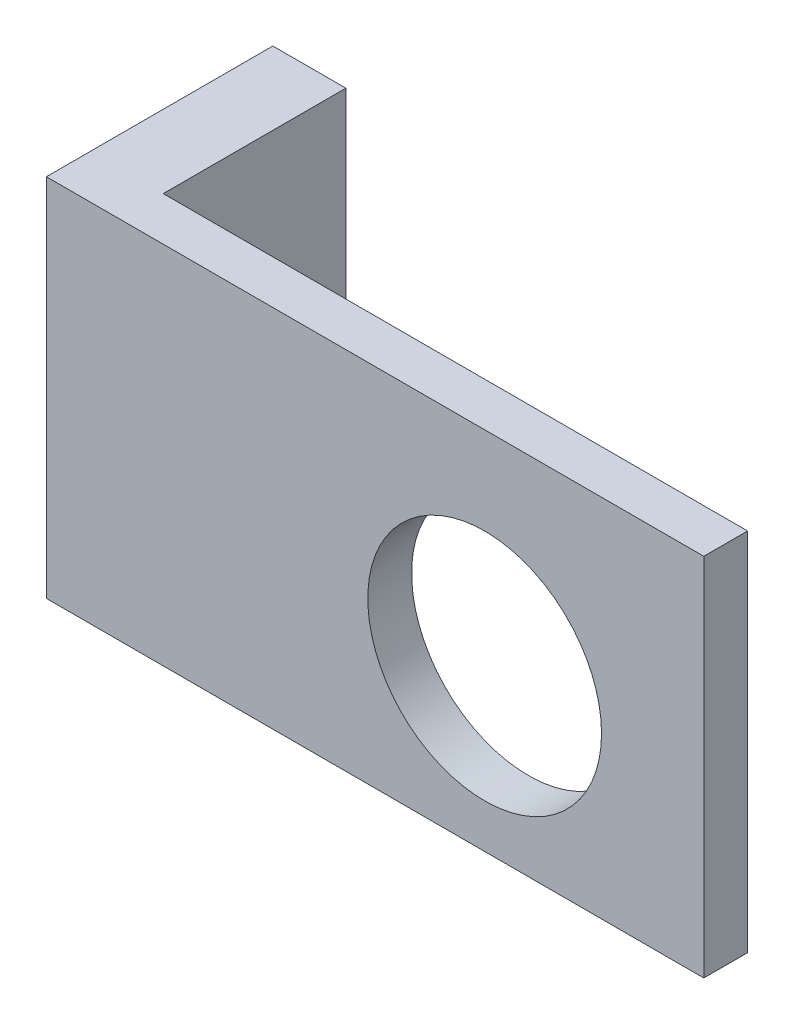
ISO-10303-21;
HEADER;
FILE_DESCRIPTION(('STEP AP214'),'2;1');
FILE_NAME('part.step','',(''),(''),'','','');
FILE_SCHEMA(('AUTOMOTIVE_DESIGN { 1 0 10303 214 1 1 1 1 }'));
ENDSEC;
DATA;
#1=APPLICATION_CONTEXT('core data for automotive mechanical design processes');
#2=APPLICATION_PROTOCOL_DEFINITION('international standard','automotive_design',2000,#1);
#3=PRODUCT_CONTEXT('',#1,'mechanical');
#4=PRODUCT('Part','Part','',(#3));
#5=PRODUCT_RELATED_PRODUCT_CATEGORY('part','',(#4));
#6=PRODUCT_DEFINITION_FORMATION('','',#4);
#7=PRODUCT_DEFINITION_CONTEXT('part definition',#1,'design');
#8=PRODUCT_DEFINITION('design','',#6,#7);
#9=PRODUCT_DEFINITION_SHAPE('','',#8);
#10=(LENGTH_UNIT() NAMED_UNIT(*) SI_UNIT(.MILLI.,.METRE.));
#11=(NAMED_UNIT(*) PLANE_ANGLE_UNIT() SI_UNIT($,.RADIAN.));
#12=(NAMED_UNIT(*) SI_UNIT($,.STERADIAN.) SOLID_ANGLE_UNIT());
#13=UNCERTAINTY_MEASURE_WITH_UNIT(LENGTH_MEASURE(1.E-05),#10,'distance_accuracy_value','');
#14=(GEOMETRIC_REPRESENTATION_CONTEXT(3) GLOBAL_UNCERTAINTY_ASSIGNED_CONTEXT((#13)) GLOBAL_UNIT_ASSIGNED_CONTEXT((#10,
#11,#12)) REPRESENTATION_CONTEXT('',''));
#15=CARTESIAN_POINT('',(0.,0.,0.));
#16=DIRECTION('',(0.,0.,1.));
#17=DIRECTION('',(1.,0.,0.));
#18=AXIS2_PLACEMENT_3D('',#15,#16,#17);
#19=CARTESIAN_POINT('',(-185.202607174297,-165.213721784756,61.8199037619954));
#20=DIRECTION('',(0.,0.,-1.));
#21=DIRECTION('',(-1.,0.,0.));
#22=AXIS2_PLACEMENT_3D('',#19,#20,#21);
#23=PLANE('',#22);
#24=DIRECTION('',(0.,-1.,0.));
#25=VECTOR('',#24,1.);
#26=CARTESIAN_POINT('',(-185.202607174297,-165.213721784756,61.8199037619954));
#27=LINE('',#26,#25);
#28=CARTESIAN_POINT('',(-185.202607174297,209.786278215244,61.8199037619954));
#29=VERTEX_POINT('',#28);
#30=CARTESIAN_POINT('',(-185.202607174297,-165.213721784756,61.8199037619954));
#31=VERTEX_POINT('',#30);
#32=EDGE_CURVE('E108',#29,#31,#27,.T.);
#33=ORIENTED_EDGE('',*,*,#32,.T.);
#34=DIRECTION('',(1.,0.,0.));
#35=VECTOR('',#34,1.);
#36=CARTESIAN_POINT('',(-185.202607174297,-165.213721784756,61.8199037619954));
#37=LINE('',#36,#35);
#38=CARTESIAN_POINT('',(489.797392825703,-165.213721784756,61.8199037619954));
#39=VERTEX_POINT('',#38);
#40=EDGE_CURVE('E87',#31,#39,#37,.T.);
#41=ORIENTED_EDGE('',*,*,#40,.T.);
#42=DIRECTION('',(0.,1.,0.));
#43=VECTOR('',#42,1.);
#44=CARTESIAN_POINT('',(489.797392825703,-165.213721784756,61.8199037619954));
#45=LINE('',#44,#43);
#46=CARTESIAN_POINT('',(489.797392825703,209.786278215244,61.8199037619954));
#47=VERTEX_POINT('',#46);
#48=EDGE_CURVE('E156',#39,#47,#45,.T.);
#49=ORIENTED_EDGE('',*,*,#48,.T.);
#50=DIRECTION('',(-1.,0.,0.));
#51=VECTOR('',#50,1.);
#52=CARTESIAN_POINT('',(-185.202607174297,209.786278215244,61.8199037619954));
#53=LINE('',#52,#51);
#54=EDGE_CURVE('E64',#47,#29,#53,.T.);
#55=ORIENTED_EDGE('',*,*,#54,.T.);
#56=EDGE_LOOP('',(#33,#41,#49,#55));
#57=FACE_BOUND('',#56,.T.);
#58=CARTESIAN_POINT('',(264.797392825703,-0.213721784755906,61.8199037619954));
#59=DIRECTION('',(0.,0.,1.));
#60=DIRECTION('',(1.,0.,0.));
#61=AXIS2_PLACEMENT_3D('',#58,#59,#60);
#62=CIRCLE('',#61,120.);
#63=CARTESIAN_POINT('',(384.797392825703,-0.213721784755906,61.8199037619954));
#64=VERTEX_POINT('',#63);
#65=EDGE_CURVE('E143',#64,#64,#62,.T.);
#66=ORIENTED_EDGE('',*,*,#65,.F.);
#67=EDGE_LOOP('',(#66));
#68=FACE_BOUND('',#67,.T.);
#69=ADVANCED_FACE('F39',(#57,#68),#23,.F.);
#70=CARTESIAN_POINT('',(-185.202607174297,-165.213721784756,16.8199037619954));
#71=DIRECTION('',(0.,0.,-1.));
#72=DIRECTION('',(-1.,0.,0.));
#73=AXIS2_PLACEMENT_3D('',#70,#71,#72);
#74=PLANE('',#73);
#75=DIRECTION('',(0.,-1.,0.));
#76=VECTOR('',#75,1.);
#77=CARTESIAN_POINT('',(-110.202607174297,209.786278215244,16.8199037619954));
#78=LINE('',#77,#76);
#79=CARTESIAN_POINT('',(-110.202607174297,209.786278215244,16.8199037619954));
#80=VERTEX_POINT('',#79);
#81=CARTESIAN_POINT('',(-110.202607174297,-165.213721784756,16.8199037619954));
#82=VERTEX_POINT('',#81);
#83=EDGE_CURVE('E55',#80,#82,#78,.T.);
#84=ORIENTED_EDGE('',*,*,#83,.F.);
#85=DIRECTION('',(-1.,0.,0.));
#86=VECTOR('',#85,1.);
#87=CARTESIAN_POINT('',(-185.202607174297,209.786278215244,16.8199037619954));
#88=LINE('',#87,#86);
#89=CARTESIAN_POINT('',(489.797392825703,209.786278215244,16.8199037619954));
#90=VERTEX_POINT('',#89);
#91=EDGE_CURVE('E153',#90,#80,#88,.T.);
#92=ORIENTED_EDGE('',*,*,#91,.F.);
#93=DIRECTION('',(0.,1.,0.));
#94=VECTOR('',#93,1.);
#95=CARTESIAN_POINT('',(489.797392825703,-165.213721784756,16.8199037619954));
#96=LINE('',#95,#94);
#97=CARTESIAN_POINT('',(489.797392825703,-165.213721784756,16.8199037619954));
#98=VERTEX_POINT('',#97);
#99=EDGE_CURVE('E80',#98,#90,#96,.T.);
#100=ORIENTED_EDGE('',*,*,#99,.F.);
#101=DIRECTION('',(1.,0.,0.));
#102=VECTOR('',#101,1.);
#103=CARTESIAN_POINT('',(-185.202607174297,-165.213721784756,16.8199037619954));
#104=LINE('',#103,#102);
#105=EDGE_CURVE('E147',#82,#98,#104,.T.);
#106=ORIENTED_EDGE('',*,*,#105,.F.);
#107=EDGE_LOOP('',(#84,#92,#100,#106));
#108=FACE_BOUND('',#107,.T.);
#109=CARTESIAN_POINT('',(264.797392825703,-0.213721784755906,16.8199037619954));
#110=DIRECTION('',(0.,0.,1.));
#111=DIRECTION('',(1.,0.,0.));
#112=AXIS2_PLACEMENT_3D('',#109,#110,#111);
#113=CIRCLE('',#112,120.);
#114=CARTESIAN_POINT('',(384.797392825703,-0.213721784755906,16.8199037619954));
#115=VERTEX_POINT('',#114);
#116=EDGE_CURVE('E142',#115,#115,#113,.T.);
#117=ORIENTED_EDGE('',*,*,#116,.T.);
#118=EDGE_LOOP('',(#117));
#119=FACE_BOUND('',#118,.T.);
#120=ADVANCED_FACE('F171',(#108,#119),#74,.T.);
#121=CARTESIAN_POINT('',(-185.202607174297,-165.213721784756,61.8199037619954));
#122=DIRECTION('',(1.,0.,0.));
#123=DIRECTION('',(0.,0.,-1.));
#124=AXIS2_PLACEMENT_3D('',#121,#122,#123);
#125=PLANE('',#124);
#126=DIRECTION('',(0.,0.,-1.));
#127=VECTOR('',#126,1.);
#128=CARTESIAN_POINT('',(-185.202607174297,209.786278215244,61.8199037619954));
#129=LINE('',#128,#127);
#130=CARTESIAN_POINT('',(-185.202607174297,209.786278215244,-170.680096238005));
#131=VERTEX_POINT('',#130);
#132=EDGE_CURVE('E103',#29,#131,#129,.T.);
#133=ORIENTED_EDGE('',*,*,#132,.T.);
#134=DIRECTION('',(0.,1.,0.));
#135=VECTOR('',#134,1.);
#136=CARTESIAN_POINT('',(-185.202607174297,209.786278215244,-170.680096238005));
#137=LINE('',#136,#135);
#138=CARTESIAN_POINT('',(-185.202607174297,-165.213721784756,-170.680096238005));
#139=VERTEX_POINT('',#138);
#140=EDGE_CURVE('E107',#139,#131,#137,.T.);
#141=ORIENTED_EDGE('',*,*,#140,.F.);
#142=DIRECTION('',(0.,0.,-1.));
#143=VECTOR('',#142,1.);
#144=CARTESIAN_POINT('',(-185.202607174297,-165.213721784756,61.8199037619954));
#145=LINE('',#144,#143);
#146=EDGE_CURVE('E11',#31,#139,#145,.T.);
#147=ORIENTED_EDGE('',*,*,#146,.F.);
#148=ORIENTED_EDGE('',*,*,#32,.F.);
#149=EDGE_LOOP('',(#133,#141,#147,#148));
#150=FACE_BOUND('',#149,.T.);
#151=ADVANCED_FACE('F41',(#150),#125,.F.);
#152=CARTESIAN_POINT('',(-185.202607174297,-165.213721784756,61.8199037619954));
#153=DIRECTION('',(0.,1.,0.));
#154=DIRECTION('',(0.,0.,1.));
#155=AXIS2_PLACEMENT_3D('',#152,#153,#154);
#156=PLANE('',#155);
#157=ORIENTED_EDGE('',*,*,#146,.T.);
#158=DIRECTION('',(-1.,0.,0.));
#159=VECTOR('',#158,1.);
#160=CARTESIAN_POINT('',(-185.202607174297,-165.213721784756,-170.680096238005));
#161=LINE('',#160,#159);
#162=CARTESIAN_POINT('',(-110.202607174297,-165.213721784756,-170.680096238005));
#163=VERTEX_POINT('',#162);
#164=EDGE_CURVE('E126',#163,#139,#161,.T.);
#165=ORIENTED_EDGE('',*,*,#164,.F.);
#166=DIRECTION('',(0.,0.,1.));
#167=VECTOR('',#166,1.);
#168=CARTESIAN_POINT('',(-110.202607174297,-165.213721784756,-170.680096238005));
#169=LINE('',#168,#167);
#170=EDGE_CURVE('E135',#163,#82,#169,.T.);
#171=ORIENTED_EDGE('',*,*,#170,.T.);
#172=ORIENTED_EDGE('',*,*,#105,.T.);
#173=DIRECTION('',(0.,0.,-1.));
#174=VECTOR('',#173,1.);
#175=CARTESIAN_POINT('',(489.797392825703,-165.213721784756,61.8199037619954));
#176=LINE('',#175,#174);
#177=EDGE_CURVE('E48',#39,#98,#176,.T.);
#178=ORIENTED_EDGE('',*,*,#177,.F.);
#179=ORIENTED_EDGE('',*,*,#40,.F.);
#180=EDGE_LOOP('',(#157,#165,#171,#172,#178,#179));
#181=FACE_BOUND('',#180,.T.);
#182=ADVANCED_FACE('F176',(#181),#156,.F.);
#183=CARTESIAN_POINT('',(489.797392825703,-165.213721784756,61.8199037619954));
#184=DIRECTION('',(-1.,0.,0.));
#185=DIRECTION('',(0.,0.,1.));
#186=AXIS2_PLACEMENT_3D('',#183,#184,#185);
#187=PLANE('',#186);
#188=ORIENTED_EDGE('',*,*,#99,.T.);
#189=DIRECTION('',(0.,0.,-1.));
#190=VECTOR('',#189,1.);
#191=CARTESIAN_POINT('',(489.797392825703,209.786278215244,61.8199037619954));
#192=LINE('',#191,#190);
#193=EDGE_CURVE('E111',#47,#90,#192,.T.);
#194=ORIENTED_EDGE('',*,*,#193,.F.);
#195=ORIENTED_EDGE('',*,*,#48,.F.);
#196=ORIENTED_EDGE('',*,*,#177,.T.);
#197=EDGE_LOOP('',(#188,#194,#195,#196));
#198=FACE_BOUND('',#197,.T.);
#199=ADVANCED_FACE('F170',(#198),#187,.F.);
#200=CARTESIAN_POINT('',(-185.202607174297,209.786278215244,61.8199037619954));
#201=DIRECTION('',(0.,-1.,0.));
#202=DIRECTION('',(0.,0.,-1.));
#203=AXIS2_PLACEMENT_3D('',#200,#201,#202);
#204=PLANE('',#203);
#205=ORIENTED_EDGE('',*,*,#91,.T.);
#206=DIRECTION('',(0.,0.,1.));
#207=VECTOR('',#206,1.);
#208=CARTESIAN_POINT('',(-110.202607174297,209.786278215244,-170.680096238005));
#209=LINE('',#208,#207);
#210=CARTESIAN_POINT('',(-110.202607174297,209.786278215244,-170.680096238005));
#211=VERTEX_POINT('',#210);
#212=EDGE_CURVE('E117',#211,#80,#209,.T.);
#213=ORIENTED_EDGE('',*,*,#212,.F.);
#214=DIRECTION('',(1.,0.,0.));
#215=VECTOR('',#214,1.);
#216=CARTESIAN_POINT('',(-185.202607174297,209.786278215244,-170.680096238005));
#217=LINE('',#216,#215);
#218=EDGE_CURVE('E114',#131,#211,#217,.T.);
#219=ORIENTED_EDGE('',*,*,#218,.F.);
#220=ORIENTED_EDGE('',*,*,#132,.F.);
#221=ORIENTED_EDGE('',*,*,#54,.F.);
#222=ORIENTED_EDGE('',*,*,#193,.T.);
#223=EDGE_LOOP('',(#205,#213,#219,#220,#221,#222));
#224=FACE_BOUND('',#223,.T.);
#225=ADVANCED_FACE('F115',(#224),#204,.F.);
#226=CARTESIAN_POINT('',(264.797392825703,-0.213721784755906,61.8199037619954));
#227=DIRECTION('',(0.,0.,-1.));
#228=DIRECTION('',(-1.,0.,0.));
#229=AXIS2_PLACEMENT_3D('',#226,#227,#228);
#230=CYLINDRICAL_SURFACE('',#229,120.);
#231=ORIENTED_EDGE('',*,*,#65,.T.);
#232=EDGE_LOOP('',(#231));
#233=FACE_BOUND('',#232,.T.);
#234=ORIENTED_EDGE('',*,*,#116,.F.);
#235=EDGE_LOOP('',(#234));
#236=FACE_BOUND('',#235,.T.);
#237=ADVANCED_FACE('F191',(#233,#236),#230,.F.);
#238=CARTESIAN_POINT('',(-110.202607174297,209.786278215244,-170.680096238005));
#239=DIRECTION('',(-1.,0.,0.));
#240=DIRECTION('',(0.,-1.,0.));
#241=AXIS2_PLACEMENT_3D('',#238,#239,#240);
#242=PLANE('',#241);
#243=ORIENTED_EDGE('',*,*,#83,.T.);
#244=ORIENTED_EDGE('',*,*,#170,.F.);
#245=DIRECTION('',(0.,-1.,0.));
#246=VECTOR('',#245,1.);
#247=CARTESIAN_POINT('',(-110.202607174297,209.786278215244,-170.680096238005));
#248=LINE('',#247,#246);
#249=EDGE_CURVE('E121',#211,#163,#248,.T.);
#250=ORIENTED_EDGE('',*,*,#249,.F.);
#251=ORIENTED_EDGE('',*,*,#212,.T.);
#252=EDGE_LOOP('',(#243,#244,#250,#251));
#253=FACE_BOUND('',#252,.T.);
#254=ADVANCED_FACE('F174',(#253),#242,.F.);
#255=CARTESIAN_POINT('',(-185.202607174297,-165.213721784756,-170.680096238005));
#256=DIRECTION('',(0.,0.,1.));
#257=DIRECTION('',(1.,0.,0.));
#258=AXIS2_PLACEMENT_3D('',#255,#256,#257);
#259=PLANE('',#258);
#260=ORIENTED_EDGE('',*,*,#140,.T.);
#261=ORIENTED_EDGE('',*,*,#218,.T.);
#262=ORIENTED_EDGE('',*,*,#249,.T.);
#263=ORIENTED_EDGE('',*,*,#164,.T.);
#264=EDGE_LOOP('',(#260,#261,#262,#263));
#265=FACE_BOUND('',#264,.T.);
#266=ADVANCED_FACE('F124',(#265),#259,.F.);
#267=CLOSED_SHELL('',(#69,#120,#151,#182,#199,#225,#237,#254,#266));
#268=MANIFOLD_SOLID_BREP('B2',#267);
#269=ADVANCED_BREP_SHAPE_REPRESENTATION('',(#18,#268),#14);
#270=SHAPE_DEFINITION_REPRESENTATION(#9,#269);
ENDSEC;
END-ISO-10303-21;
